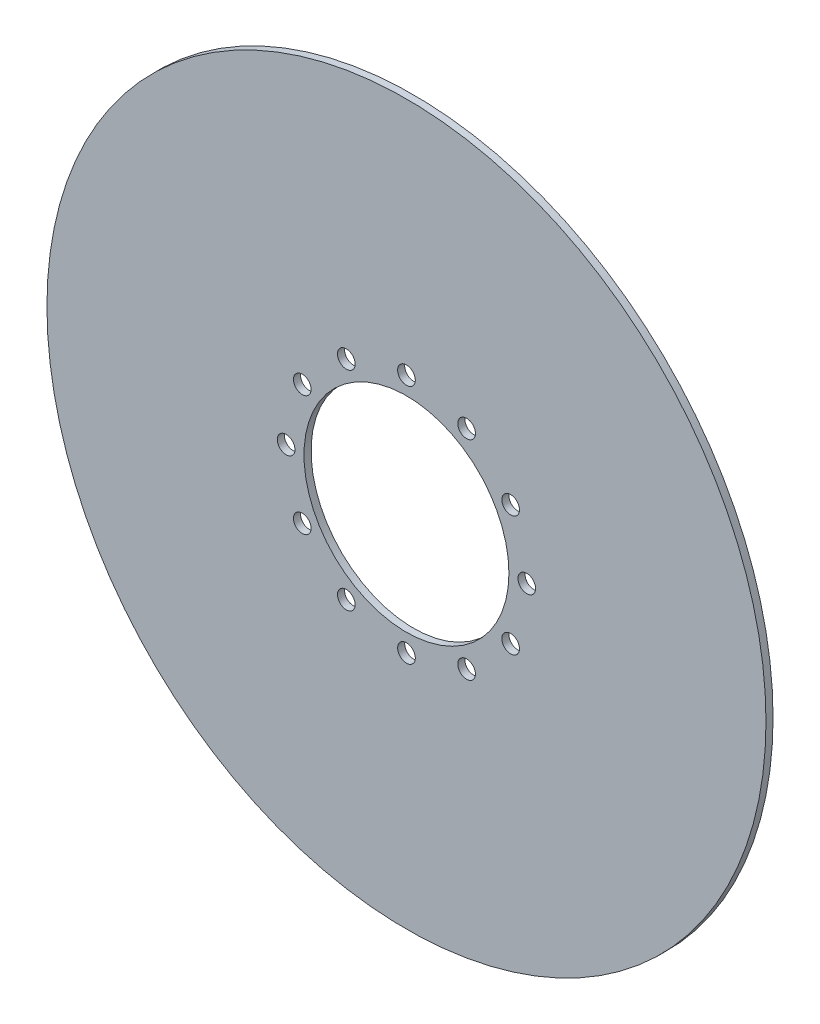
ISO-10303-21;
HEADER;
FILE_DESCRIPTION(('STEP AP214'),'2;1');
FILE_NAME('part.step','',(''),(''),'','','');
FILE_SCHEMA(('AUTOMOTIVE_DESIGN { 1 0 10303 214 1 1 1 1 }'));
ENDSEC;
DATA;
#1=APPLICATION_CONTEXT('core data for automotive mechanical design processes');
#2=APPLICATION_PROTOCOL_DEFINITION('international standard','automotive_design',2000,#1);
#3=PRODUCT_CONTEXT('',#1,'mechanical');
#4=PRODUCT('Part','Part','',(#3));
#5=PRODUCT_RELATED_PRODUCT_CATEGORY('part','',(#4));
#6=PRODUCT_DEFINITION_FORMATION('','',#4);
#7=PRODUCT_DEFINITION_CONTEXT('part definition',#1,'design');
#8=PRODUCT_DEFINITION('design','',#6,#7);
#9=PRODUCT_DEFINITION_SHAPE('','',#8);
#10=(LENGTH_UNIT() NAMED_UNIT(*) SI_UNIT(.MILLI.,.METRE.));
#11=(NAMED_UNIT(*) PLANE_ANGLE_UNIT() SI_UNIT($,.RADIAN.));
#12=(NAMED_UNIT(*) SI_UNIT($,.STERADIAN.) SOLID_ANGLE_UNIT());
#13=UNCERTAINTY_MEASURE_WITH_UNIT(LENGTH_MEASURE(1.E-05),#10,'distance_accuracy_value','');
#14=(GEOMETRIC_REPRESENTATION_CONTEXT(3) GLOBAL_UNCERTAINTY_ASSIGNED_CONTEXT((#13)) GLOBAL_UNIT_ASSIGNED_CONTEXT((#10,
#11,#12)) REPRESENTATION_CONTEXT('',''));
#15=CARTESIAN_POINT('',(0.,0.,0.));
#16=DIRECTION('',(0.,0.,1.));
#17=DIRECTION('',(1.,0.,0.));
#18=AXIS2_PLACEMENT_3D('',#15,#16,#17);
#19=CARTESIAN_POINT('',(0.,0.,-2.));
#20=DIRECTION('',(0.,0.,-1.));
#21=DIRECTION('',(1.,0.,0.));
#22=AXIS2_PLACEMENT_3D('',#19,#20,#21);
#23=PLANE('',#22);
#24=CARTESIAN_POINT('',(-29.4448637286702,16.9999999999987,-2.));
#25=DIRECTION('',(0.,0.,1.));
#26=DIRECTION('',(1.,0.,0.));
#27=AXIS2_PLACEMENT_3D('',#24,#25,#26);
#28=CIRCLE('',#27,2.49698906987796);
#29=CARTESIAN_POINT('',(-26.9478746587923,16.9999999999987,-2.));
#30=VERTEX_POINT('',#29);
#31=EDGE_CURVE('E109',#30,#30,#28,.T.);
#32=ORIENTED_EDGE('',*,*,#31,.T.);
#33=EDGE_LOOP('',(#32));
#34=FACE_BOUND('',#33,.T.);
#35=CARTESIAN_POINT('',(-29.4448637286688,-17.0000000000013,-2.));
#36=DIRECTION('',(0.,0.,1.));
#37=DIRECTION('',(1.,0.,0.));
#38=AXIS2_PLACEMENT_3D('',#35,#36,#37);
#39=CIRCLE('',#38,2.49698906987796);
#40=CARTESIAN_POINT('',(-26.9478746587908,-17.0000000000013,-2.));
#41=VERTEX_POINT('',#40);
#42=EDGE_CURVE('E97',#41,#41,#39,.T.);
#43=ORIENTED_EDGE('',*,*,#42,.T.);
#44=EDGE_LOOP('',(#43));
#45=FACE_BOUND('',#44,.T.);
#46=CARTESIAN_POINT('',(2.86804195578331E-12,-34.,-2.));
#47=DIRECTION('',(0.,0.,1.));
#48=DIRECTION('',(1.,0.,0.));
#49=AXIS2_PLACEMENT_3D('',#46,#47,#48);
#50=CIRCLE('',#49,2.49698906987796);
#51=CARTESIAN_POINT('',(2.49698906988083,-34.,-2.));
#52=VERTEX_POINT('',#51);
#53=EDGE_CURVE('E85',#52,#52,#50,.T.);
#54=ORIENTED_EDGE('',*,*,#53,.T.);
#55=EDGE_LOOP('',(#54));
#56=FACE_BOUND('',#55,.T.);
#57=CARTESIAN_POINT('',(29.4448637286731,-16.9999999999988,-2.));
#58=DIRECTION('',(0.,0.,1.));
#59=DIRECTION('',(1.,0.,0.));
#60=AXIS2_PLACEMENT_3D('',#57,#58,#59);
#61=CIRCLE('',#60,2.49698906987769);
#62=CARTESIAN_POINT('',(31.9418527985508,-16.9999999999988,-2.));
#63=VERTEX_POINT('',#62);
#64=EDGE_CURVE('E73',#63,#63,#61,.T.);
#65=ORIENTED_EDGE('',*,*,#64,.T.);
#66=EDGE_LOOP('',(#65));
#67=FACE_BOUND('',#66,.T.);
#68=CARTESIAN_POINT('',(29.4448637286716,17.0000000000012,-2.));
#69=DIRECTION('',(0.,0.,1.));
#70=DIRECTION('',(1.,0.,0.));
#71=AXIS2_PLACEMENT_3D('',#68,#69,#70);
#72=CIRCLE('',#71,2.49698906987796);
#73=CARTESIAN_POINT('',(31.9418527985496,17.0000000000012,-2.));
#74=VERTEX_POINT('',#73);
#75=EDGE_CURVE('E61',#74,#74,#72,.T.);
#76=ORIENTED_EDGE('',*,*,#75,.T.);
#77=EDGE_LOOP('',(#76));
#78=FACE_BOUND('',#77,.T.);
#79=CARTESIAN_POINT('',(0.,34.,-2.));
#80=DIRECTION('',(0.,0.,1.));
#81=DIRECTION('',(1.,0.,0.));
#82=AXIS2_PLACEMENT_3D('',#79,#80,#81);
#83=CIRCLE('',#82,2.49698906987796);
#84=CARTESIAN_POINT('',(2.49698906987796,34.,-2.));
#85=VERTEX_POINT('',#84);
#86=EDGE_CURVE('E49',#85,#85,#83,.T.);
#87=ORIENTED_EDGE('',*,*,#86,.T.);
#88=EDGE_LOOP('',(#87));
#89=FACE_BOUND('',#88,.T.);
#90=CARTESIAN_POINT('',(0.,0.,-2.));
#91=DIRECTION('',(0.,0.,1.));
#92=DIRECTION('',(1.,0.,0.));
#93=AXIS2_PLACEMENT_3D('',#90,#91,#92);
#94=CIRCLE('',#93,101.6);
#95=CARTESIAN_POINT('',(101.6,0.,-2.));
#96=VERTEX_POINT('',#95);
#97=EDGE_CURVE('E10',#96,#96,#94,.T.);
#98=ORIENTED_EDGE('',*,*,#97,.F.);
#99=EDGE_LOOP('',(#98));
#100=FACE_BOUND('',#99,.T.);
#101=CARTESIAN_POINT('',(0.,0.,-2.));
#102=DIRECTION('',(0.,0.,1.));
#103=DIRECTION('',(1.,0.,0.));
#104=AXIS2_PLACEMENT_3D('',#101,#102,#103);
#105=CIRCLE('',#104,28.956);
#106=CARTESIAN_POINT('',(28.956,0.,-2.));
#107=VERTEX_POINT('',#106);
#108=EDGE_CURVE('E44',#107,#107,#105,.T.);
#109=ORIENTED_EDGE('',*,*,#108,.T.);
#110=EDGE_LOOP('',(#109));
#111=FACE_BOUND('',#110,.T.);
#112=CARTESIAN_POINT('',(17.0000000000002,29.4448637286716,-2.));
#113=DIRECTION('',(0.,0.,1.));
#114=DIRECTION('',(1.,0.,0.));
#115=AXIS2_PLACEMENT_3D('',#112,#113,#114);
#116=CIRCLE('',#115,2.49698906987796);
#117=CARTESIAN_POINT('',(19.4969890698782,29.4448637286716,-2.));
#118=VERTEX_POINT('',#117);
#119=EDGE_CURVE('E55',#118,#118,#116,.T.);
#120=ORIENTED_EDGE('',*,*,#119,.T.);
#121=EDGE_LOOP('',(#120));
#122=FACE_BOUND('',#121,.T.);
#123=CARTESIAN_POINT('',(34.0000000000014,1.43402097789165E-12,-2.));
#124=DIRECTION('',(0.,0.,1.));
#125=DIRECTION('',(1.,0.,0.));
#126=AXIS2_PLACEMENT_3D('',#123,#124,#125);
#127=CIRCLE('',#126,2.49698906987796);
#128=CARTESIAN_POINT('',(36.4969890698794,1.43402097789165E-12,-2.));
#129=VERTEX_POINT('',#128);
#130=EDGE_CURVE('E67',#129,#129,#127,.T.);
#131=ORIENTED_EDGE('',*,*,#130,.T.);
#132=EDGE_LOOP('',(#131));
#133=FACE_BOUND('',#132,.T.);
#134=CARTESIAN_POINT('',(17.0000000000027,-29.4448637286702,-2.));
#135=DIRECTION('',(0.,0.,1.));
#136=DIRECTION('',(1.,0.,0.));
#137=AXIS2_PLACEMENT_3D('',#134,#135,#136);
#138=CIRCLE('',#137,2.49698906987837);
#139=CARTESIAN_POINT('',(19.4969890698811,-29.4448637286702,-2.));
#140=VERTEX_POINT('',#139);
#141=EDGE_CURVE('E79',#140,#140,#138,.T.);
#142=ORIENTED_EDGE('',*,*,#141,.T.);
#143=EDGE_LOOP('',(#142));
#144=FACE_BOUND('',#143,.T.);
#145=CARTESIAN_POINT('',(-16.9999999999973,-29.4448637286716,-2.));
#146=DIRECTION('',(0.,0.,1.));
#147=DIRECTION('',(1.,0.,0.));
#148=AXIS2_PLACEMENT_3D('',#145,#146,#147);
#149=CIRCLE('',#148,2.49698906987796);
#150=CARTESIAN_POINT('',(-14.5030109301194,-29.4448637286716,-2.));
#151=VERTEX_POINT('',#150);
#152=EDGE_CURVE('E91',#151,#151,#149,.T.);
#153=ORIENTED_EDGE('',*,*,#152,.T.);
#154=EDGE_LOOP('',(#153));
#155=FACE_BOUND('',#154,.T.);
#156=CARTESIAN_POINT('',(-33.9999999999986,-1.43818477700875E-12,-2.));
#157=DIRECTION('',(0.,0.,1.));
#158=DIRECTION('',(1.,0.,0.));
#159=AXIS2_PLACEMENT_3D('',#156,#157,#158);
#160=CIRCLE('',#159,2.49698906987796);
#161=CARTESIAN_POINT('',(-31.5030109301206,-1.43818477700875E-12,-2.));
#162=VERTEX_POINT('',#161);
#163=EDGE_CURVE('E103',#162,#162,#160,.T.);
#164=ORIENTED_EDGE('',*,*,#163,.T.);
#165=EDGE_LOOP('',(#164));
#166=FACE_BOUND('',#165,.T.);
#167=CARTESIAN_POINT('',(-16.9999999999998,29.4448637286702,-2.));
#168=DIRECTION('',(0.,0.,1.));
#169=DIRECTION('',(1.,0.,0.));
#170=AXIS2_PLACEMENT_3D('',#167,#168,#169);
#171=CIRCLE('',#170,2.49698906987796);
#172=CARTESIAN_POINT('',(-14.5030109301219,29.4448637286702,-2.));
#173=VERTEX_POINT('',#172);
#174=EDGE_CURVE('E115',#173,#173,#171,.T.);
#175=ORIENTED_EDGE('',*,*,#174,.T.);
#176=EDGE_LOOP('',(#175));
#177=FACE_BOUND('',#176,.T.);
#178=ADVANCED_FACE('F33',(#34,#45,#56,#67,#78,#89,#100,#111,#122,#133,#144,#155,#166,#177),#23,.T.);
#179=CARTESIAN_POINT('',(0.,0.,0.));
#180=DIRECTION('',(0.,0.,-1.));
#181=DIRECTION('',(1.,0.,0.));
#182=AXIS2_PLACEMENT_3D('',#179,#180,#181);
#183=PLANE('',#182);
#184=CARTESIAN_POINT('',(0.,0.,0.));
#185=DIRECTION('',(0.,0.,1.));
#186=DIRECTION('',(1.,0.,0.));
#187=AXIS2_PLACEMENT_3D('',#184,#185,#186);
#188=CIRCLE('',#187,101.6);
#189=CARTESIAN_POINT('',(101.6,0.,0.));
#190=VERTEX_POINT('',#189);
#191=EDGE_CURVE('E37',#190,#190,#188,.T.);
#192=ORIENTED_EDGE('',*,*,#191,.T.);
#193=EDGE_LOOP('',(#192));
#194=FACE_BOUND('',#193,.T.);
#195=CARTESIAN_POINT('',(0.,0.,0.));
#196=DIRECTION('',(0.,0.,1.));
#197=DIRECTION('',(1.,0.,0.));
#198=AXIS2_PLACEMENT_3D('',#195,#196,#197);
#199=CIRCLE('',#198,28.956);
#200=CARTESIAN_POINT('',(28.956,0.,0.));
#201=VERTEX_POINT('',#200);
#202=EDGE_CURVE('E46',#201,#201,#199,.T.);
#203=ORIENTED_EDGE('',*,*,#202,.F.);
#204=EDGE_LOOP('',(#203));
#205=FACE_BOUND('',#204,.T.);
#206=CARTESIAN_POINT('',(0.,34.,0.));
#207=DIRECTION('',(0.,0.,1.));
#208=DIRECTION('',(1.,0.,0.));
#209=AXIS2_PLACEMENT_3D('',#206,#207,#208);
#210=CIRCLE('',#209,2.49698906987796);
#211=CARTESIAN_POINT('',(2.49698906987796,34.,0.));
#212=VERTEX_POINT('',#211);
#213=EDGE_CURVE('E52',#212,#212,#210,.T.);
#214=ORIENTED_EDGE('',*,*,#213,.F.);
#215=EDGE_LOOP('',(#214));
#216=FACE_BOUND('',#215,.T.);
#217=CARTESIAN_POINT('',(17.0000000000002,29.4448637286716,0.));
#218=DIRECTION('',(0.,0.,1.));
#219=DIRECTION('',(1.,0.,0.));
#220=AXIS2_PLACEMENT_3D('',#217,#218,#219);
#221=CIRCLE('',#220,2.49698906987796);
#222=CARTESIAN_POINT('',(19.4969890698782,29.4448637286716,0.));
#223=VERTEX_POINT('',#222);
#224=EDGE_CURVE('E58',#223,#223,#221,.T.);
#225=ORIENTED_EDGE('',*,*,#224,.F.);
#226=EDGE_LOOP('',(#225));
#227=FACE_BOUND('',#226,.T.);
#228=CARTESIAN_POINT('',(29.4448637286716,17.0000000000012,0.));
#229=DIRECTION('',(0.,0.,1.));
#230=DIRECTION('',(1.,0.,0.));
#231=AXIS2_PLACEMENT_3D('',#228,#229,#230);
#232=CIRCLE('',#231,2.49698906987796);
#233=CARTESIAN_POINT('',(31.9418527985496,17.0000000000012,0.));
#234=VERTEX_POINT('',#233);
#235=EDGE_CURVE('E64',#234,#234,#232,.T.);
#236=ORIENTED_EDGE('',*,*,#235,.F.);
#237=EDGE_LOOP('',(#236));
#238=FACE_BOUND('',#237,.T.);
#239=CARTESIAN_POINT('',(34.0000000000014,1.43402097789165E-12,0.));
#240=DIRECTION('',(0.,0.,1.));
#241=DIRECTION('',(1.,0.,0.));
#242=AXIS2_PLACEMENT_3D('',#239,#240,#241);
#243=CIRCLE('',#242,2.49698906987796);
#244=CARTESIAN_POINT('',(36.4969890698794,1.43402097789165E-12,0.));
#245=VERTEX_POINT('',#244);
#246=EDGE_CURVE('E70',#245,#245,#243,.T.);
#247=ORIENTED_EDGE('',*,*,#246,.F.);
#248=EDGE_LOOP('',(#247));
#249=FACE_BOUND('',#248,.T.);
#250=CARTESIAN_POINT('',(29.4448637286731,-16.9999999999988,0.));
#251=DIRECTION('',(0.,0.,1.));
#252=DIRECTION('',(1.,0.,0.));
#253=AXIS2_PLACEMENT_3D('',#250,#251,#252);
#254=CIRCLE('',#253,2.49698906987769);
#255=CARTESIAN_POINT('',(31.9418527985508,-16.9999999999988,0.));
#256=VERTEX_POINT('',#255);
#257=EDGE_CURVE('E76',#256,#256,#254,.T.);
#258=ORIENTED_EDGE('',*,*,#257,.F.);
#259=EDGE_LOOP('',(#258));
#260=FACE_BOUND('',#259,.T.);
#261=CARTESIAN_POINT('',(17.0000000000027,-29.4448637286702,0.));
#262=DIRECTION('',(0.,0.,1.));
#263=DIRECTION('',(1.,0.,0.));
#264=AXIS2_PLACEMENT_3D('',#261,#262,#263);
#265=CIRCLE('',#264,2.49698906987837);
#266=CARTESIAN_POINT('',(19.4969890698811,-29.4448637286702,0.));
#267=VERTEX_POINT('',#266);
#268=EDGE_CURVE('E82',#267,#267,#265,.T.);
#269=ORIENTED_EDGE('',*,*,#268,.F.);
#270=EDGE_LOOP('',(#269));
#271=FACE_BOUND('',#270,.T.);
#272=CARTESIAN_POINT('',(2.86804195578331E-12,-34.,0.));
#273=DIRECTION('',(0.,0.,1.));
#274=DIRECTION('',(1.,0.,0.));
#275=AXIS2_PLACEMENT_3D('',#272,#273,#274);
#276=CIRCLE('',#275,2.49698906987796);
#277=CARTESIAN_POINT('',(2.49698906988083,-34.,0.));
#278=VERTEX_POINT('',#277);
#279=EDGE_CURVE('E88',#278,#278,#276,.T.);
#280=ORIENTED_EDGE('',*,*,#279,.F.);
#281=EDGE_LOOP('',(#280));
#282=FACE_BOUND('',#281,.T.);
#283=CARTESIAN_POINT('',(-16.9999999999973,-29.4448637286716,0.));
#284=DIRECTION('',(0.,0.,1.));
#285=DIRECTION('',(1.,0.,0.));
#286=AXIS2_PLACEMENT_3D('',#283,#284,#285);
#287=CIRCLE('',#286,2.49698906987796);
#288=CARTESIAN_POINT('',(-14.5030109301194,-29.4448637286716,0.));
#289=VERTEX_POINT('',#288);
#290=EDGE_CURVE('E94',#289,#289,#287,.T.);
#291=ORIENTED_EDGE('',*,*,#290,.F.);
#292=EDGE_LOOP('',(#291));
#293=FACE_BOUND('',#292,.T.);
#294=CARTESIAN_POINT('',(-29.4448637286688,-17.0000000000013,0.));
#295=DIRECTION('',(0.,0.,1.));
#296=DIRECTION('',(1.,0.,0.));
#297=AXIS2_PLACEMENT_3D('',#294,#295,#296);
#298=CIRCLE('',#297,2.49698906987796);
#299=CARTESIAN_POINT('',(-26.9478746587908,-17.0000000000013,0.));
#300=VERTEX_POINT('',#299);
#301=EDGE_CURVE('E100',#300,#300,#298,.T.);
#302=ORIENTED_EDGE('',*,*,#301,.F.);
#303=EDGE_LOOP('',(#302));
#304=FACE_BOUND('',#303,.T.);
#305=CARTESIAN_POINT('',(-33.9999999999986,-1.43818477700875E-12,0.));
#306=DIRECTION('',(0.,0.,1.));
#307=DIRECTION('',(1.,0.,0.));
#308=AXIS2_PLACEMENT_3D('',#305,#306,#307);
#309=CIRCLE('',#308,2.49698906987796);
#310=CARTESIAN_POINT('',(-31.5030109301206,-1.43818477700875E-12,0.));
#311=VERTEX_POINT('',#310);
#312=EDGE_CURVE('E106',#311,#311,#309,.T.);
#313=ORIENTED_EDGE('',*,*,#312,.F.);
#314=EDGE_LOOP('',(#313));
#315=FACE_BOUND('',#314,.T.);
#316=CARTESIAN_POINT('',(-29.4448637286702,16.9999999999987,0.));
#317=DIRECTION('',(0.,0.,1.));
#318=DIRECTION('',(1.,0.,0.));
#319=AXIS2_PLACEMENT_3D('',#316,#317,#318);
#320=CIRCLE('',#319,2.49698906987796);
#321=CARTESIAN_POINT('',(-26.9478746587923,16.9999999999987,0.));
#322=VERTEX_POINT('',#321);
#323=EDGE_CURVE('E112',#322,#322,#320,.T.);
#324=ORIENTED_EDGE('',*,*,#323,.F.);
#325=EDGE_LOOP('',(#324));
#326=FACE_BOUND('',#325,.T.);
#327=CARTESIAN_POINT('',(-16.9999999999998,29.4448637286702,0.));
#328=DIRECTION('',(0.,0.,1.));
#329=DIRECTION('',(1.,0.,0.));
#330=AXIS2_PLACEMENT_3D('',#327,#328,#329);
#331=CIRCLE('',#330,2.49698906987796);
#332=CARTESIAN_POINT('',(-14.5030109301219,29.4448637286702,0.));
#333=VERTEX_POINT('',#332);
#334=EDGE_CURVE('E118',#333,#333,#331,.T.);
#335=ORIENTED_EDGE('',*,*,#334,.F.);
#336=EDGE_LOOP('',(#335));
#337=FACE_BOUND('',#336,.T.);
#338=ADVANCED_FACE('F132',(#194,#205,#216,#227,#238,#249,#260,#271,#282,#293,#304,#315,#326,
#337),#183,.F.);
#339=CARTESIAN_POINT('',(0.,0.,-2.));
#340=DIRECTION('',(0.,0.,1.));
#341=DIRECTION('',(-1.,0.,0.));
#342=AXIS2_PLACEMENT_3D('',#339,#340,#341);
#343=CYLINDRICAL_SURFACE('',#342,101.6);
#344=ORIENTED_EDGE('',*,*,#97,.T.);
#345=EDGE_LOOP('',(#344));
#346=FACE_BOUND('',#345,.T.);
#347=ORIENTED_EDGE('',*,*,#191,.F.);
#348=EDGE_LOOP('',(#347));
#349=FACE_BOUND('',#348,.T.);
#350=ADVANCED_FACE('F35',(#346,#349),#343,.T.);
#351=CARTESIAN_POINT('',(0.,0.,-2.));
#352=DIRECTION('',(0.,0.,1.));
#353=DIRECTION('',(-1.,0.,0.));
#354=AXIS2_PLACEMENT_3D('',#351,#352,#353);
#355=CYLINDRICAL_SURFACE('',#354,28.956);
#356=ORIENTED_EDGE('',*,*,#108,.F.);
#357=EDGE_LOOP('',(#356));
#358=FACE_BOUND('',#357,.T.);
#359=ORIENTED_EDGE('',*,*,#202,.T.);
#360=EDGE_LOOP('',(#359));
#361=FACE_BOUND('',#360,.T.);
#362=ADVANCED_FACE('F139',(#358,#361),#355,.F.);
#363=CARTESIAN_POINT('',(0.,34.,-2.));
#364=DIRECTION('',(0.,0.,1.));
#365=DIRECTION('',(-1.,0.,0.));
#366=AXIS2_PLACEMENT_3D('',#363,#364,#365);
#367=CYLINDRICAL_SURFACE('',#366,2.49698906987796);
#368=ORIENTED_EDGE('',*,*,#86,.F.);
#369=EDGE_LOOP('',(#368));
#370=FACE_BOUND('',#369,.T.);
#371=ORIENTED_EDGE('',*,*,#213,.T.);
#372=EDGE_LOOP('',(#371));
#373=FACE_BOUND('',#372,.T.);
#374=ADVANCED_FACE('F146',(#370,#373),#367,.F.);
#375=CARTESIAN_POINT('',(17.0000000000002,29.4448637286716,-2.));
#376=DIRECTION('',(0.,0.,1.));
#377=DIRECTION('',(-1.,0.,0.));
#378=AXIS2_PLACEMENT_3D('',#375,#376,#377);
#379=CYLINDRICAL_SURFACE('',#378,2.49698906987796);
#380=ORIENTED_EDGE('',*,*,#119,.F.);
#381=EDGE_LOOP('',(#380));
#382=FACE_BOUND('',#381,.T.);
#383=ORIENTED_EDGE('',*,*,#224,.T.);
#384=EDGE_LOOP('',(#383));
#385=FACE_BOUND('',#384,.T.);
#386=ADVANCED_FACE('F150',(#382,#385),#379,.F.);
#387=CARTESIAN_POINT('',(29.4448637286716,17.0000000000012,-2.));
#388=DIRECTION('',(0.,0.,1.));
#389=DIRECTION('',(-1.,0.,0.));
#390=AXIS2_PLACEMENT_3D('',#387,#388,#389);
#391=CYLINDRICAL_SURFACE('',#390,2.49698906987796);
#392=ORIENTED_EDGE('',*,*,#75,.F.);
#393=EDGE_LOOP('',(#392));
#394=FACE_BOUND('',#393,.T.);
#395=ORIENTED_EDGE('',*,*,#235,.T.);
#396=EDGE_LOOP('',(#395));
#397=FACE_BOUND('',#396,.T.);
#398=ADVANCED_FACE('F154',(#394,#397),#391,.F.);
#399=CARTESIAN_POINT('',(34.0000000000014,1.43402097789165E-12,-2.));
#400=DIRECTION('',(0.,0.,1.));
#401=DIRECTION('',(-1.,0.,0.));
#402=AXIS2_PLACEMENT_3D('',#399,#400,#401);
#403=CYLINDRICAL_SURFACE('',#402,2.49698906987796);
#404=ORIENTED_EDGE('',*,*,#130,.F.);
#405=EDGE_LOOP('',(#404));
#406=FACE_BOUND('',#405,.T.);
#407=ORIENTED_EDGE('',*,*,#246,.T.);
#408=EDGE_LOOP('',(#407));
#409=FACE_BOUND('',#408,.T.);
#410=ADVANCED_FACE('F158',(#406,#409),#403,.F.);
#411=CARTESIAN_POINT('',(29.4448637286731,-16.9999999999988,-2.));
#412=DIRECTION('',(0.,0.,1.));
#413=DIRECTION('',(-1.,0.,0.));
#414=AXIS2_PLACEMENT_3D('',#411,#412,#413);
#415=CYLINDRICAL_SURFACE('',#414,2.49698906987769);
#416=ORIENTED_EDGE('',*,*,#64,.F.);
#417=EDGE_LOOP('',(#416));
#418=FACE_BOUND('',#417,.T.);
#419=ORIENTED_EDGE('',*,*,#257,.T.);
#420=EDGE_LOOP('',(#419));
#421=FACE_BOUND('',#420,.T.);
#422=ADVANCED_FACE('F162',(#418,#421),#415,.F.);
#423=CARTESIAN_POINT('',(17.0000000000027,-29.4448637286702,-2.));
#424=DIRECTION('',(0.,0.,1.));
#425=DIRECTION('',(-1.,0.,0.));
#426=AXIS2_PLACEMENT_3D('',#423,#424,#425);
#427=CYLINDRICAL_SURFACE('',#426,2.49698906987837);
#428=ORIENTED_EDGE('',*,*,#141,.F.);
#429=EDGE_LOOP('',(#428));
#430=FACE_BOUND('',#429,.T.);
#431=ORIENTED_EDGE('',*,*,#268,.T.);
#432=EDGE_LOOP('',(#431));
#433=FACE_BOUND('',#432,.T.);
#434=ADVANCED_FACE('F166',(#430,#433),#427,.F.);
#435=CARTESIAN_POINT('',(2.86804195578331E-12,-34.,-2.));
#436=DIRECTION('',(0.,0.,1.));
#437=DIRECTION('',(-1.,0.,0.));
#438=AXIS2_PLACEMENT_3D('',#435,#436,#437);
#439=CYLINDRICAL_SURFACE('',#438,2.49698906987796);
#440=ORIENTED_EDGE('',*,*,#53,.F.);
#441=EDGE_LOOP('',(#440));
#442=FACE_BOUND('',#441,.T.);
#443=ORIENTED_EDGE('',*,*,#279,.T.);
#444=EDGE_LOOP('',(#443));
#445=FACE_BOUND('',#444,.T.);
#446=ADVANCED_FACE('F170',(#442,#445),#439,.F.);
#447=CARTESIAN_POINT('',(-16.9999999999973,-29.4448637286716,-2.));
#448=DIRECTION('',(0.,0.,1.));
#449=DIRECTION('',(-1.,0.,0.));
#450=AXIS2_PLACEMENT_3D('',#447,#448,#449);
#451=CYLINDRICAL_SURFACE('',#450,2.49698906987796);
#452=ORIENTED_EDGE('',*,*,#152,.F.);
#453=EDGE_LOOP('',(#452));
#454=FACE_BOUND('',#453,.T.);
#455=ORIENTED_EDGE('',*,*,#290,.T.);
#456=EDGE_LOOP('',(#455));
#457=FACE_BOUND('',#456,.T.);
#458=ADVANCED_FACE('F174',(#454,#457),#451,.F.);
#459=CARTESIAN_POINT('',(-29.4448637286688,-17.0000000000013,-2.));
#460=DIRECTION('',(0.,0.,1.));
#461=DIRECTION('',(-1.,0.,0.));
#462=AXIS2_PLACEMENT_3D('',#459,#460,#461);
#463=CYLINDRICAL_SURFACE('',#462,2.49698906987796);
#464=ORIENTED_EDGE('',*,*,#42,.F.);
#465=EDGE_LOOP('',(#464));
#466=FACE_BOUND('',#465,.T.);
#467=ORIENTED_EDGE('',*,*,#301,.T.);
#468=EDGE_LOOP('',(#467));
#469=FACE_BOUND('',#468,.T.);
#470=ADVANCED_FACE('F178',(#466,#469),#463,.F.);
#471=CARTESIAN_POINT('',(-33.9999999999986,-1.43818477700875E-12,-2.));
#472=DIRECTION('',(0.,0.,1.));
#473=DIRECTION('',(-1.,0.,0.));
#474=AXIS2_PLACEMENT_3D('',#471,#472,#473);
#475=CYLINDRICAL_SURFACE('',#474,2.49698906987796);
#476=ORIENTED_EDGE('',*,*,#163,.F.);
#477=EDGE_LOOP('',(#476));
#478=FACE_BOUND('',#477,.T.);
#479=ORIENTED_EDGE('',*,*,#312,.T.);
#480=EDGE_LOOP('',(#479));
#481=FACE_BOUND('',#480,.T.);
#482=ADVANCED_FACE('F182',(#478,#481),#475,.F.);
#483=CARTESIAN_POINT('',(-29.4448637286702,16.9999999999987,-2.));
#484=DIRECTION('',(0.,0.,1.));
#485=DIRECTION('',(-1.,0.,0.));
#486=AXIS2_PLACEMENT_3D('',#483,#484,#485);
#487=CYLINDRICAL_SURFACE('',#486,2.49698906987796);
#488=ORIENTED_EDGE('',*,*,#31,.F.);
#489=EDGE_LOOP('',(#488));
#490=FACE_BOUND('',#489,.T.);
#491=ORIENTED_EDGE('',*,*,#323,.T.);
#492=EDGE_LOOP('',(#491));
#493=FACE_BOUND('',#492,.T.);
#494=ADVANCED_FACE('F128',(#490,#493),#487,.F.);
#495=CARTESIAN_POINT('',(-16.9999999999998,29.4448637286702,-2.));
#496=DIRECTION('',(0.,0.,1.));
#497=DIRECTION('',(-1.,0.,0.));
#498=AXIS2_PLACEMENT_3D('',#495,#496,#497);
#499=CYLINDRICAL_SURFACE('',#498,2.49698906987796);
#500=ORIENTED_EDGE('',*,*,#174,.F.);
#501=EDGE_LOOP('',(#500));
#502=FACE_BOUND('',#501,.T.);
#503=ORIENTED_EDGE('',*,*,#334,.T.);
#504=EDGE_LOOP('',(#503));
#505=FACE_BOUND('',#504,.T.);
#506=ADVANCED_FACE('F125',(#502,#505),#499,.F.);
#507=CLOSED_SHELL('',(#178,#338,#350,#362,#374,#386,#398,#410,#422,#434,#446,#458,#470,#482,
#494,#506));
#508=MANIFOLD_SOLID_BREP('B2',#507);
#509=ADVANCED_BREP_SHAPE_REPRESENTATION('',(#18,#508),#14);
#510=SHAPE_DEFINITION_REPRESENTATION(#9,#509);
ENDSEC;
END-ISO-10303-21;
